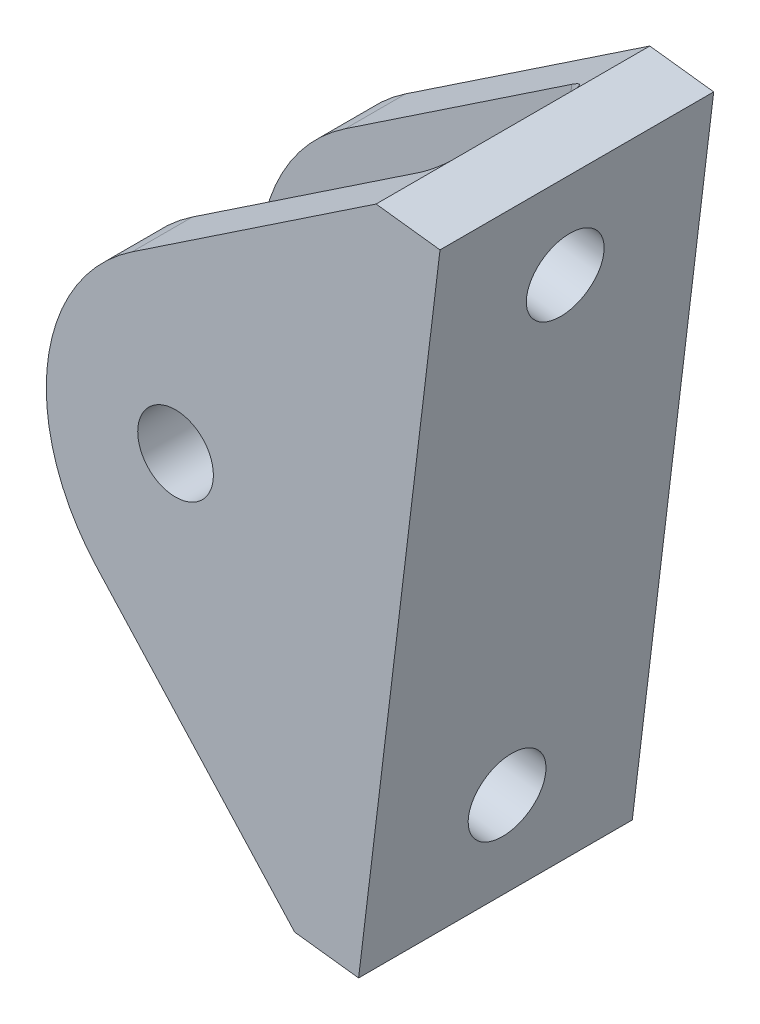
ISO-10303-21;
HEADER;
FILE_DESCRIPTION(('STEP AP214'),'2;1');
FILE_NAME('part.step','',(''),(''),'','','');
FILE_SCHEMA(('AUTOMOTIVE_DESIGN { 1 0 10303 214 1 1 1 1 }'));
ENDSEC;
DATA;
#1=APPLICATION_CONTEXT('core data for automotive mechanical design processes');
#2=APPLICATION_PROTOCOL_DEFINITION('international standard','automotive_design',2000,#1);
#3=PRODUCT_CONTEXT('',#1,'mechanical');
#4=PRODUCT('Part','Part','',(#3));
#5=PRODUCT_RELATED_PRODUCT_CATEGORY('part','',(#4));
#6=PRODUCT_DEFINITION_FORMATION('','',#4);
#7=PRODUCT_DEFINITION_CONTEXT('part definition',#1,'design');
#8=PRODUCT_DEFINITION('design','',#6,#7);
#9=PRODUCT_DEFINITION_SHAPE('','',#8);
#10=(LENGTH_UNIT() NAMED_UNIT(*) SI_UNIT(.MILLI.,.METRE.));
#11=(NAMED_UNIT(*) PLANE_ANGLE_UNIT() SI_UNIT($,.RADIAN.));
#12=(NAMED_UNIT(*) SI_UNIT($,.STERADIAN.) SOLID_ANGLE_UNIT());
#13=UNCERTAINTY_MEASURE_WITH_UNIT(LENGTH_MEASURE(1.E-05),#10,'distance_accuracy_value','');
#14=(GEOMETRIC_REPRESENTATION_CONTEXT(3) GLOBAL_UNCERTAINTY_ASSIGNED_CONTEXT((#13)) GLOBAL_UNIT_ASSIGNED_CONTEXT((#10,
#11,#12)) REPRESENTATION_CONTEXT('',''));
#15=CARTESIAN_POINT('',(0.,0.,0.));
#16=DIRECTION('',(0.,0.,1.));
#17=DIRECTION('',(1.,0.,0.));
#18=AXIS2_PLACEMENT_3D('',#15,#16,#17);
#19=CARTESIAN_POINT('',(-43.8883990487637,47.6307972317961,129.45));
#20=DIRECTION('',(0.55644779287138,-0.830882575222618,0.));
#21=DIRECTION('',(0.830882575222618,0.55644779287138,0.));
#22=AXIS2_PLACEMENT_3D('',#19,#20,#21);
#23=PLANE('',#22);
#24=DIRECTION('',(0.830882575222618,0.55644779287138,0.));
#25=VECTOR('',#24,1.);
#26=CARTESIAN_POINT('',(-43.8883990487637,47.6307972317961,125.7));
#27=LINE('',#26,#25);
#28=CARTESIAN_POINT('',(-59.0505832356892,37.4765778781606,125.7));
#29=VERTEX_POINT('',#28);
#30=CARTESIAN_POINT('',(-44.9847814916762,46.8965423458537,125.7));
#31=VERTEX_POINT('',#30);
#32=EDGE_CURVE('E142',#29,#31,#27,.T.);
#33=ORIENTED_EDGE('',*,*,#32,.F.);
#34=DIRECTION('',(0.,0.,-1.));
#35=VECTOR('',#34,1.);
#36=CARTESIAN_POINT('',(-59.0505832356892,37.4765778781606,129.45));
#37=LINE('',#36,#35);
#38=CARTESIAN_POINT('',(-59.0505832356892,37.4765778781606,129.45));
#39=VERTEX_POINT('',#38);
#40=EDGE_CURVE('E141',#39,#29,#37,.T.);
#41=ORIENTED_EDGE('',*,*,#40,.F.);
#42=DIRECTION('',(-0.830882575222618,-0.55644779287138,0.));
#43=VECTOR('',#42,1.);
#44=CARTESIAN_POINT('',(-43.8883990487637,47.6307972317961,129.45));
#45=LINE('',#44,#43);
#46=CARTESIAN_POINT('',(-43.8883990487637,47.6307972317961,129.45));
#47=VERTEX_POINT('',#46);
#48=EDGE_CURVE('E228',#47,#39,#45,.T.);
#49=ORIENTED_EDGE('',*,*,#48,.F.);
#50=DIRECTION('',(0.,0.,-1.));
#51=VECTOR('',#50,1.);
#52=CARTESIAN_POINT('',(-43.8883990487637,47.6307972317961,129.45));
#53=LINE('',#52,#51);
#54=CARTESIAN_POINT('',(-43.8883990487637,47.6307972317961,124.7));
#55=VERTEX_POINT('',#54);
#56=EDGE_CURVE('E155',#47,#55,#53,.T.);
#57=ORIENTED_EDGE('',*,*,#56,.T.);
#58=CARTESIAN_POINT('',(-44.9847814916762,46.8965423458537,124.7));
#59=DIRECTION('',(0.55644779287138,-0.830882575222618,0.));
#60=DIRECTION('',(0.830882575222618,0.55644779287138,0.));
#61=AXIS2_PLACEMENT_3D('',#58,#59,#60);
#62=ELLIPSE('',#61,1.31953957828363,1.);
#63=EDGE_CURVE('E177',#55,#31,#62,.T.);
#64=ORIENTED_EDGE('',*,*,#63,.T.);
#65=EDGE_LOOP('',(#33,#41,#49,#57,#64));
#66=FACE_BOUND('',#65,.T.);
#67=ADVANCED_FACE('F36',(#66),#23,.F.);
#68=CARTESIAN_POINT('',(-52.3732097212326,27.5059869754892,129.45));
#69=DIRECTION('',(0.,0.,-1.));
#70=DIRECTION('',(-1.,0.,0.));
#71=AXIS2_PLACEMENT_3D('',#68,#69,#70);
#72=CYLINDRICAL_SURFACE('',#71,12.);
#73=CARTESIAN_POINT('',(-52.3732097212326,27.5059869754892,125.7));
#74=DIRECTION('',(0.,0.,-1.));
#75=DIRECTION('',(-1.,0.,0.));
#76=AXIS2_PLACEMENT_3D('',#73,#74,#75);
#77=CIRCLE('',#76,12.);
#78=CARTESIAN_POINT('',(-61.2404899313599,19.4207323922936,125.7));
#79=VERTEX_POINT('',#78);
#80=EDGE_CURVE('E123',#79,#29,#77,.T.);
#81=ORIENTED_EDGE('',*,*,#80,.F.);
#82=DIRECTION('',(0.,0.,-1.));
#83=VECTOR('',#82,1.);
#84=CARTESIAN_POINT('',(-61.2404899313599,19.4207323922936,129.45));
#85=LINE('',#84,#83);
#86=CARTESIAN_POINT('',(-61.2404899313599,19.4207323922936,129.45));
#87=VERTEX_POINT('',#86);
#88=EDGE_CURVE('E138',#87,#79,#85,.T.);
#89=ORIENTED_EDGE('',*,*,#88,.F.);
#90=CARTESIAN_POINT('',(-52.3732097212326,27.5059869754892,129.45));
#91=DIRECTION('',(0.,0.,1.));
#92=DIRECTION('',(1.,0.,0.));
#93=AXIS2_PLACEMENT_3D('',#90,#91,#92);
#94=CIRCLE('',#93,12.);
#95=EDGE_CURVE('E230',#39,#87,#94,.T.);
#96=ORIENTED_EDGE('',*,*,#95,.F.);
#97=ORIENTED_EDGE('',*,*,#40,.T.);
#98=EDGE_LOOP('',(#81,#89,#96,#97));
#99=FACE_BOUND('',#98,.T.);
#100=ADVANCED_FACE('F136',(#99),#72,.T.);
#101=CARTESIAN_POINT('',(-61.2404899313599,19.4207323922936,129.45));
#102=DIRECTION('',(0.738940017510608,0.673771215266297,0.));
#103=DIRECTION('',(-0.673771215266297,0.738940017510608,0.));
#104=AXIS2_PLACEMENT_3D('',#101,#102,#103);
#105=PLANE('',#104);
#106=DIRECTION('',(-0.673771215266297,0.738940017510608,0.));
#107=VECTOR('',#106,1.);
#108=CARTESIAN_POINT('',(-61.2404899313599,19.4207323922936,125.7));
#109=LINE('',#108,#107);
#110=CARTESIAN_POINT('',(-49.8343868099661,6.91140303942213,125.7));
#111=VERTEX_POINT('',#110);
#112=EDGE_CURVE('E119',#111,#79,#109,.T.);
#113=ORIENTED_EDGE('',*,*,#112,.F.);
#114=CARTESIAN_POINT('',(-49.8343868099661,6.91140303942213,124.7));
#115=DIRECTION('',(0.738940017510608,0.673771215266297,0.));
#116=DIRECTION('',(-0.673771215266297,0.738940017510608,0.));
#117=AXIS2_PLACEMENT_3D('',#114,#115,#116);
#118=ELLIPSE('',#117,1.31953957828363,1.);
#119=CARTESIAN_POINT('',(-48.9453190247139,5.93634244033928,124.7));
#120=VERTEX_POINT('',#119);
#121=EDGE_CURVE('E179',#111,#120,#118,.T.);
#122=ORIENTED_EDGE('',*,*,#121,.T.);
#123=DIRECTION('',(0.,0.,-1.));
#124=VECTOR('',#123,1.);
#125=CARTESIAN_POINT('',(-48.9453190247139,5.93634244033928,129.45));
#126=LINE('',#125,#124);
#127=CARTESIAN_POINT('',(-48.9453190247139,5.93634244033928,129.45));
#128=VERTEX_POINT('',#127);
#129=EDGE_CURVE('E151',#128,#120,#126,.T.);
#130=ORIENTED_EDGE('',*,*,#129,.F.);
#131=DIRECTION('',(0.673771215266297,-0.738940017510608,0.));
#132=VECTOR('',#131,1.);
#133=CARTESIAN_POINT('',(-61.2404899313599,19.4207323922936,129.45));
#134=LINE('',#133,#132);
#135=EDGE_CURVE('E146',#87,#128,#134,.T.);
#136=ORIENTED_EDGE('',*,*,#135,.F.);
#137=ORIENTED_EDGE('',*,*,#88,.T.);
#138=EDGE_LOOP('',(#113,#122,#130,#136,#137));
#139=FACE_BOUND('',#138,.T.);
#140=ADVANCED_FACE('F144',(#139),#105,.F.);
#141=CARTESIAN_POINT('',(-56.3441101775619,27.9875984017701,129.45));
#142=DIRECTION('',(0.,0.,-1.));
#143=DIRECTION('',(-1.,0.,0.));
#144=AXIS2_PLACEMENT_3D('',#141,#142,#143);
#145=CYLINDRICAL_SURFACE('',#144,2.35);
#146=CARTESIAN_POINT('',(-56.3441101775619,27.9875984017701,129.45));
#147=DIRECTION('',(0.,0.,1.));
#148=DIRECTION('',(1.,0.,0.));
#149=AXIS2_PLACEMENT_3D('',#146,#147,#148);
#150=CIRCLE('',#149,2.35);
#151=CARTESIAN_POINT('',(-53.9941101775619,27.9875984017701,129.45));
#152=VERTEX_POINT('',#151);
#153=EDGE_CURVE('E216',#152,#152,#150,.T.);
#154=ORIENTED_EDGE('',*,*,#153,.T.);
#155=EDGE_LOOP('',(#154));
#156=FACE_BOUND('',#155,.T.);
#157=CARTESIAN_POINT('',(-56.3441101775619,27.9875984017701,125.7));
#158=DIRECTION('',(0.,0.,-1.));
#159=DIRECTION('',(-1.,0.,0.));
#160=AXIS2_PLACEMENT_3D('',#157,#158,#159);
#161=CIRCLE('',#160,2.35);
#162=CARTESIAN_POINT('',(-58.6941101775619,27.9875984017701,125.7));
#163=VERTEX_POINT('',#162);
#164=EDGE_CURVE('E131',#163,#163,#161,.T.);
#165=ORIENTED_EDGE('',*,*,#164,.T.);
#166=EDGE_LOOP('',(#165));
#167=FACE_BOUND('',#166,.T.);
#168=ADVANCED_FACE('F314',(#156,#167),#145,.F.);
#169=CARTESIAN_POINT('',(-52.3732097212326,27.5059869754892,129.45));
#170=DIRECTION('',(0.,0.,1.));
#171=DIRECTION('',(1.,0.,0.));
#172=AXIS2_PLACEMENT_3D('',#169,#170,#171);
#173=PLANE('',#172);
#174=DIRECTION('',(0.120402856570244,0.992725114082305,0.));
#175=VECTOR('',#174,1.);
#176=CARTESIAN_POINT('',(-39.9174985924345,47.1491858055151,129.45));
#177=LINE('',#176,#175);
#178=CARTESIAN_POINT('',(-44.9744185683847,5.45473101405832,129.45));
#179=VERTEX_POINT('',#178);
#180=CARTESIAN_POINT('',(-39.9174985924345,47.1491858055151,129.45));
#181=VERTEX_POINT('',#180);
#182=EDGE_CURVE('E222',#179,#181,#177,.T.);
#183=ORIENTED_EDGE('',*,*,#182,.T.);
#184=DIRECTION('',(-0.992725114082305,0.120402856570242,0.));
#185=VECTOR('',#184,1.);
#186=CARTESIAN_POINT('',(-43.8883990487637,47.6307972317961,129.45));
#187=LINE('',#186,#185);
#188=EDGE_CURVE('E225',#181,#47,#187,.T.);
#189=ORIENTED_EDGE('',*,*,#188,.T.);
#190=ORIENTED_EDGE('',*,*,#48,.T.);
#191=ORIENTED_EDGE('',*,*,#95,.T.);
#192=ORIENTED_EDGE('',*,*,#135,.T.);
#193=DIRECTION('',(0.992725114082305,-0.120402856570242,0.));
#194=VECTOR('',#193,1.);
#195=CARTESIAN_POINT('',(-44.9744185683847,5.45473101405832,129.45));
#196=LINE('',#195,#194);
#197=EDGE_CURVE('E233',#128,#179,#196,.T.);
#198=ORIENTED_EDGE('',*,*,#197,.T.);
#199=EDGE_LOOP('',(#183,#189,#190,#191,#192,#198));
#200=FACE_BOUND('',#199,.T.);
#201=ORIENTED_EDGE('',*,*,#153,.F.);
#202=EDGE_LOOP('',(#201));
#203=FACE_BOUND('',#202,.T.);
#204=ADVANCED_FACE('F265',(#200,#203),#173,.T.);
#205=CARTESIAN_POINT('',(-52.3732097212326,27.5059869754892,112.45));
#206=DIRECTION('',(0.,0.,1.));
#207=DIRECTION('',(1.,0.,0.));
#208=AXIS2_PLACEMENT_3D('',#205,#206,#207);
#209=PLANE('',#208);
#210=DIRECTION('',(0.120402856570244,0.992725114082305,0.));
#211=VECTOR('',#210,1.);
#212=CARTESIAN_POINT('',(-39.9174985924345,47.1491858055151,112.45));
#213=LINE('',#212,#211);
#214=CARTESIAN_POINT('',(-44.9744185683847,5.45473101405832,112.45));
#215=VERTEX_POINT('',#214);
#216=CARTESIAN_POINT('',(-39.9174985924345,47.1491858055151,112.45));
#217=VERTEX_POINT('',#216);
#218=EDGE_CURVE('E219',#215,#217,#213,.T.);
#219=ORIENTED_EDGE('',*,*,#218,.F.);
#220=DIRECTION('',(0.992725114082305,-0.120402856570242,0.));
#221=VECTOR('',#220,1.);
#222=CARTESIAN_POINT('',(-44.9744185683847,5.45473101405832,112.45));
#223=LINE('',#222,#221);
#224=CARTESIAN_POINT('',(-48.9453190247139,5.93634244033928,112.45));
#225=VERTEX_POINT('',#224);
#226=EDGE_CURVE('E226',#225,#215,#223,.T.);
#227=ORIENTED_EDGE('',*,*,#226,.F.);
#228=DIRECTION('',(0.673771215266297,-0.738940017510608,0.));
#229=VECTOR('',#228,1.);
#230=CARTESIAN_POINT('',(-61.2404899313599,19.4207323922936,112.45));
#231=LINE('',#230,#229);
#232=CARTESIAN_POINT('',(-61.2404899313599,19.4207323922936,112.45));
#233=VERTEX_POINT('',#232);
#234=EDGE_CURVE('E245',#233,#225,#231,.T.);
#235=ORIENTED_EDGE('',*,*,#234,.F.);
#236=CARTESIAN_POINT('',(-52.3732097212326,27.5059869754892,112.45));
#237=DIRECTION('',(0.,0.,1.));
#238=DIRECTION('',(1.,0.,0.));
#239=AXIS2_PLACEMENT_3D('',#236,#237,#238);
#240=CIRCLE('',#239,12.);
#241=CARTESIAN_POINT('',(-59.0505832356892,37.4765778781606,112.45));
#242=VERTEX_POINT('',#241);
#243=EDGE_CURVE('E242',#242,#233,#240,.T.);
#244=ORIENTED_EDGE('',*,*,#243,.F.);
#245=DIRECTION('',(-0.830882575222618,-0.55644779287138,0.));
#246=VECTOR('',#245,1.);
#247=CARTESIAN_POINT('',(-43.8883990487637,47.6307972317961,112.45));
#248=LINE('',#247,#246);
#249=CARTESIAN_POINT('',(-43.8883990487637,47.6307972317961,112.45));
#250=VERTEX_POINT('',#249);
#251=EDGE_CURVE('E240',#250,#242,#248,.T.);
#252=ORIENTED_EDGE('',*,*,#251,.F.);
#253=DIRECTION('',(-0.992725114082305,0.120402856570242,0.));
#254=VECTOR('',#253,1.);
#255=CARTESIAN_POINT('',(-43.8883990487637,47.6307972317961,112.45));
#256=LINE('',#255,#254);
#257=EDGE_CURVE('E238',#217,#250,#256,.T.);
#258=ORIENTED_EDGE('',*,*,#257,.F.);
#259=EDGE_LOOP('',(#219,#227,#235,#244,#252,#258));
#260=FACE_BOUND('',#259,.T.);
#261=CARTESIAN_POINT('',(-56.3441101775619,27.9875984017701,112.45));
#262=DIRECTION('',(0.,0.,1.));
#263=DIRECTION('',(1.,0.,0.));
#264=AXIS2_PLACEMENT_3D('',#261,#262,#263);
#265=CIRCLE('',#264,2.35);
#266=CARTESIAN_POINT('',(-53.9941101775619,27.9875984017701,112.45));
#267=VERTEX_POINT('',#266);
#268=EDGE_CURVE('E215',#267,#267,#265,.T.);
#269=ORIENTED_EDGE('',*,*,#268,.T.);
#270=EDGE_LOOP('',(#269));
#271=FACE_BOUND('',#270,.T.);
#272=ADVANCED_FACE('F256',(#260,#271),#209,.F.);
#273=CARTESIAN_POINT('',(-39.9174985924345,47.1491858055151,129.45));
#274=DIRECTION('',(-0.992725114082305,0.120402856570244,0.));
#275=DIRECTION('',(-0.120402856570244,-0.992725114082305,0.));
#276=AXIS2_PLACEMENT_3D('',#273,#274,#275);
#277=PLANE('',#276);
#278=CARTESIAN_POINT('',(-44.2520014289633,11.4110816985521,120.95));
#279=DIRECTION('',(-0.992725114082305,0.120402856570244,0.));
#280=DIRECTION('',(-0.120402856570244,-0.992725114082305,0.));
#281=AXIS2_PLACEMENT_3D('',#278,#279,#280);
#282=CIRCLE('',#281,2.4);
#283=CARTESIAN_POINT('',(-44.5409682847318,9.02854142475462,120.95));
#284=VERTEX_POINT('',#283);
#285=EDGE_CURVE('E440',#284,#284,#282,.T.);
#286=ORIENTED_EDGE('',*,*,#285,.T.);
#287=EDGE_LOOP('',(#286));
#288=FACE_BOUND('',#287,.T.);
#289=CARTESIAN_POINT('',(-40.639915731856,41.1928351210213,120.95));
#290=DIRECTION('',(-0.992725114082305,0.120402856570244,0.));
#291=DIRECTION('',(-0.120402856570244,-0.992725114082305,0.));
#292=AXIS2_PLACEMENT_3D('',#289,#290,#291);
#293=CIRCLE('',#292,2.4);
#294=CARTESIAN_POINT('',(-40.9288825876245,38.8102948472238,120.95));
#295=VERTEX_POINT('',#294);
#296=EDGE_CURVE('E202',#295,#295,#293,.T.);
#297=ORIENTED_EDGE('',*,*,#296,.T.);
#298=EDGE_LOOP('',(#297));
#299=FACE_BOUND('',#298,.T.);
#300=ORIENTED_EDGE('',*,*,#218,.T.);
#301=DIRECTION('',(0.,0.,-1.));
#302=VECTOR('',#301,1.);
#303=CARTESIAN_POINT('',(-39.9174985924345,47.1491858055151,129.45));
#304=LINE('',#303,#302);
#305=EDGE_CURVE('E157',#181,#217,#304,.T.);
#306=ORIENTED_EDGE('',*,*,#305,.F.);
#307=ORIENTED_EDGE('',*,*,#182,.F.);
#308=DIRECTION('',(0.,0.,-1.));
#309=VECTOR('',#308,1.);
#310=CARTESIAN_POINT('',(-44.9744185683847,5.45473101405832,129.45));
#311=LINE('',#310,#309);
#312=EDGE_CURVE('E235',#179,#215,#311,.T.);
#313=ORIENTED_EDGE('',*,*,#312,.T.);
#314=EDGE_LOOP('',(#300,#306,#307,#313));
#315=FACE_BOUND('',#314,.T.);
#316=ADVANCED_FACE('F252',(#288,#299,#315),#277,.F.);
#317=CARTESIAN_POINT('',(-43.8883990487637,47.6307972317961,129.45));
#318=DIRECTION('',(-0.120402856570242,-0.992725114082305,0.));
#319=DIRECTION('',(0.992725114082305,-0.120402856570242,0.));
#320=AXIS2_PLACEMENT_3D('',#317,#318,#319);
#321=PLANE('',#320);
#322=ORIENTED_EDGE('',*,*,#257,.T.);
#323=CARTESIAN_POINT('',(-43.8883990487637,47.6307972317961,117.2));
#324=VERTEX_POINT('',#323);
#325=EDGE_CURVE('E52',#324,#250,#53,.T.);
#326=ORIENTED_EDGE('',*,*,#325,.F.);
#327=DIRECTION('',(0.,0.,1.));
#328=VECTOR('',#327,1.);
#329=CARTESIAN_POINT('',(-43.8883990487637,47.6307972317961,116.2));
#330=LINE('',#329,#328);
#331=EDGE_CURVE('E163',#324,#55,#330,.T.);
#332=ORIENTED_EDGE('',*,*,#331,.T.);
#333=ORIENTED_EDGE('',*,*,#56,.F.);
#334=ORIENTED_EDGE('',*,*,#188,.F.);
#335=ORIENTED_EDGE('',*,*,#305,.T.);
#336=EDGE_LOOP('',(#322,#326,#332,#333,#334,#335));
#337=FACE_BOUND('',#336,.T.);
#338=ADVANCED_FACE('F261',(#337),#321,.F.);
#339=CARTESIAN_POINT('',(-59.0505832356892,37.4765778781606,116.2));
#340=VERTEX_POINT('',#339);
#341=EDGE_CURVE('E147',#340,#242,#37,.T.);
#342=ORIENTED_EDGE('',*,*,#341,.F.);
#343=DIRECTION('',(0.830882575222618,0.55644779287138,0.));
#344=VECTOR('',#343,1.);
#345=CARTESIAN_POINT('',(-43.8883990487637,47.6307972317961,116.2));
#346=LINE('',#345,#344);
#347=CARTESIAN_POINT('',(-44.9847814916762,46.8965423458537,116.2));
#348=VERTEX_POINT('',#347);
#349=EDGE_CURVE('E187',#340,#348,#346,.T.);
#350=ORIENTED_EDGE('',*,*,#349,.T.);
#351=CARTESIAN_POINT('',(-44.9847814916762,46.8965423458537,117.2));
#352=DIRECTION('',(0.55644779287138,-0.830882575222618,0.));
#353=DIRECTION('',(-0.830882575222618,-0.55644779287138,0.));
#354=AXIS2_PLACEMENT_3D('',#351,#352,#353);
#355=ELLIPSE('',#354,1.31953957828363,1.);
#356=EDGE_CURVE('E45',#348,#324,#355,.T.);
#357=ORIENTED_EDGE('',*,*,#356,.T.);
#358=ORIENTED_EDGE('',*,*,#325,.T.);
#359=ORIENTED_EDGE('',*,*,#251,.T.);
#360=EDGE_LOOP('',(#342,#350,#357,#358,#359));
#361=FACE_BOUND('',#360,.T.);
#362=ADVANCED_FACE('F185',(#361),#23,.F.);
#363=CARTESIAN_POINT('',(-61.2404899313599,19.4207323922936,116.2));
#364=VERTEX_POINT('',#363);
#365=EDGE_CURVE('E148',#364,#233,#85,.T.);
#366=ORIENTED_EDGE('',*,*,#365,.F.);
#367=CARTESIAN_POINT('',(-52.3732097212326,27.5059869754892,116.2));
#368=DIRECTION('',(0.,0.,-1.));
#369=DIRECTION('',(-1.,0.,0.));
#370=AXIS2_PLACEMENT_3D('',#367,#368,#369);
#371=CIRCLE('',#370,12.);
#372=EDGE_CURVE('E211',#364,#340,#371,.T.);
#373=ORIENTED_EDGE('',*,*,#372,.T.);
#374=ORIENTED_EDGE('',*,*,#341,.T.);
#375=ORIENTED_EDGE('',*,*,#243,.T.);
#376=EDGE_LOOP('',(#366,#373,#374,#375));
#377=FACE_BOUND('',#376,.T.);
#378=ADVANCED_FACE('F278',(#377),#72,.T.);
#379=CARTESIAN_POINT('',(-48.9453190247139,5.93634244033928,117.2));
#380=VERTEX_POINT('',#379);
#381=EDGE_CURVE('E199',#380,#225,#126,.T.);
#382=ORIENTED_EDGE('',*,*,#381,.F.);
#383=CARTESIAN_POINT('',(-49.8343868099661,6.91140303942213,117.2));
#384=DIRECTION('',(0.738940017510608,0.673771215266297,0.));
#385=DIRECTION('',(0.673771215266297,-0.738940017510608,0.));
#386=AXIS2_PLACEMENT_3D('',#383,#384,#385);
#387=ELLIPSE('',#386,1.31953957828363,1.);
#388=CARTESIAN_POINT('',(-49.8343868099661,6.91140303942213,116.2));
#389=VERTEX_POINT('',#388);
#390=EDGE_CURVE('E11',#380,#389,#387,.T.);
#391=ORIENTED_EDGE('',*,*,#390,.T.);
#392=DIRECTION('',(-0.673771215266297,0.738940017510608,0.));
#393=VECTOR('',#392,1.);
#394=CARTESIAN_POINT('',(-61.2404899313599,19.4207323922936,116.2));
#395=LINE('',#394,#393);
#396=EDGE_CURVE('E167',#389,#364,#395,.T.);
#397=ORIENTED_EDGE('',*,*,#396,.T.);
#398=ORIENTED_EDGE('',*,*,#365,.T.);
#399=ORIENTED_EDGE('',*,*,#234,.T.);
#400=EDGE_LOOP('',(#382,#391,#397,#398,#399));
#401=FACE_BOUND('',#400,.T.);
#402=ADVANCED_FACE('F285',(#401),#105,.F.);
#403=CARTESIAN_POINT('',(-44.9744185683847,5.45473101405832,129.45));
#404=DIRECTION('',(0.120402856570242,0.992725114082305,0.));
#405=DIRECTION('',(-0.992725114082305,0.120402856570242,0.));
#406=AXIS2_PLACEMENT_3D('',#403,#404,#405);
#407=PLANE('',#406);
#408=ORIENTED_EDGE('',*,*,#226,.T.);
#409=ORIENTED_EDGE('',*,*,#312,.F.);
#410=ORIENTED_EDGE('',*,*,#197,.F.);
#411=ORIENTED_EDGE('',*,*,#129,.T.);
#412=DIRECTION('',(0.,0.,1.));
#413=VECTOR('',#412,1.);
#414=CARTESIAN_POINT('',(-48.9453190247139,5.93634244033928,116.2));
#415=LINE('',#414,#413);
#416=EDGE_CURVE('E195',#380,#120,#415,.T.);
#417=ORIENTED_EDGE('',*,*,#416,.F.);
#418=ORIENTED_EDGE('',*,*,#381,.T.);
#419=EDGE_LOOP('',(#408,#409,#410,#411,#417,#418));
#420=FACE_BOUND('',#419,.T.);
#421=ADVANCED_FACE('F198',(#420),#407,.F.);
#422=CARTESIAN_POINT('',(-56.3441101775619,27.9875984017701,116.2));
#423=DIRECTION('',(0.,0.,-1.));
#424=DIRECTION('',(-1.,0.,0.));
#425=AXIS2_PLACEMENT_3D('',#422,#423,#424);
#426=CIRCLE('',#425,2.35);
#427=CARTESIAN_POINT('',(-58.6941101775619,27.9875984017701,116.2));
#428=VERTEX_POINT('',#427);
#429=EDGE_CURVE('E164',#428,#428,#426,.T.);
#430=ORIENTED_EDGE('',*,*,#429,.F.);
#431=EDGE_LOOP('',(#430));
#432=FACE_BOUND('',#431,.T.);
#433=ORIENTED_EDGE('',*,*,#268,.F.);
#434=EDGE_LOOP('',(#433));
#435=FACE_BOUND('',#434,.T.);
#436=ADVANCED_FACE('F310',(#432,#435),#145,.F.);
#437=CARTESIAN_POINT('',(0.,0.,116.2));
#438=DIRECTION('',(0.,0.,-1.));
#439=DIRECTION('',(-1.,0.,0.));
#440=AXIS2_PLACEMENT_3D('',#437,#438,#439);
#441=PLANE('',#440);
#442=ORIENTED_EDGE('',*,*,#429,.T.);
#443=EDGE_LOOP('',(#442));
#444=FACE_BOUND('',#443,.T.);
#445=ORIENTED_EDGE('',*,*,#396,.F.);
#446=DIRECTION('',(0.120402856570244,0.992725114082305,0.));
#447=VECTOR('',#446,1.);
#448=CARTESIAN_POINT('',(-44.881124162846,47.7512000883663,116.2));
#449=LINE('',#448,#447);
#450=EDGE_CURVE('E174',#389,#348,#449,.T.);
#451=ORIENTED_EDGE('',*,*,#450,.T.);
#452=ORIENTED_EDGE('',*,*,#349,.F.);
#453=ORIENTED_EDGE('',*,*,#372,.F.);
#454=EDGE_LOOP('',(#445,#451,#452,#453));
#455=FACE_BOUND('',#454,.T.);
#456=ADVANCED_FACE('F303',(#444,#455),#441,.F.);
#457=CARTESIAN_POINT('',(0.,0.,125.7));
#458=DIRECTION('',(0.,0.,-1.));
#459=DIRECTION('',(-1.,0.,0.));
#460=AXIS2_PLACEMENT_3D('',#457,#458,#459);
#461=PLANE('',#460);
#462=ORIENTED_EDGE('',*,*,#164,.F.);
#463=EDGE_LOOP('',(#462));
#464=FACE_BOUND('',#463,.T.);
#465=ORIENTED_EDGE('',*,*,#32,.T.);
#466=DIRECTION('',(0.120402856570244,0.992725114082305,0.));
#467=VECTOR('',#466,1.);
#468=CARTESIAN_POINT('',(-49.9380441387962,6.05674529690954,125.7));
#469=LINE('',#468,#467);
#470=EDGE_CURVE('E126',#31,#111,#469,.F.);
#471=ORIENTED_EDGE('',*,*,#470,.T.);
#472=ORIENTED_EDGE('',*,*,#112,.T.);
#473=ORIENTED_EDGE('',*,*,#80,.T.);
#474=EDGE_LOOP('',(#465,#471,#472,#473));
#475=FACE_BOUND('',#474,.T.);
#476=ADVANCED_FACE('F122',(#464,#475),#461,.T.);
#477=CARTESIAN_POINT('',(-48.9453190247139,5.93634244033928,116.2));
#478=DIRECTION('',(0.992725114082305,-0.120402856570244,0.));
#479=DIRECTION('',(0.120402856570244,0.992725114082305,0.));
#480=AXIS2_PLACEMENT_3D('',#477,#478,#479);
#481=PLANE('',#480);
#482=CARTESIAN_POINT('',(-48.2229018852925,11.8926931248331,120.95));
#483=DIRECTION('',(-0.992725114082305,0.120402856570244,0.));
#484=DIRECTION('',(-0.120402856570244,-0.992725114082305,0.));
#485=AXIS2_PLACEMENT_3D('',#482,#483,#484);
#486=CIRCLE('',#485,2.4);
#487=CARTESIAN_POINT('',(-48.5118687410611,9.51015285103559,120.95));
#488=VERTEX_POINT('',#487);
#489=EDGE_CURVE('E442',#488,#488,#486,.T.);
#490=ORIENTED_EDGE('',*,*,#489,.F.);
#491=EDGE_LOOP('',(#490));
#492=FACE_BOUND('',#491,.T.);
#493=CARTESIAN_POINT('',(-44.6108161881852,41.6744465473023,120.95));
#494=DIRECTION('',(-0.992725114082305,0.120402856570244,0.));
#495=DIRECTION('',(-0.120402856570244,-0.992725114082305,0.));
#496=AXIS2_PLACEMENT_3D('',#493,#494,#495);
#497=CIRCLE('',#496,2.4);
#498=CARTESIAN_POINT('',(-44.8997830439537,39.2919062735047,120.95));
#499=VERTEX_POINT('',#498);
#500=EDGE_CURVE('E206',#499,#499,#497,.T.);
#501=ORIENTED_EDGE('',*,*,#500,.F.);
#502=EDGE_LOOP('',(#501));
#503=FACE_BOUND('',#502,.T.);
#504=ORIENTED_EDGE('',*,*,#416,.T.);
#505=DIRECTION('',(0.120402856570244,0.992725114082305,0.));
#506=VECTOR('',#505,1.);
#507=CARTESIAN_POINT('',(-48.9453190247139,5.93634244033928,124.7));
#508=LINE('',#507,#506);
#509=EDGE_CURVE('E170',#120,#55,#508,.T.);
#510=ORIENTED_EDGE('',*,*,#509,.T.);
#511=ORIENTED_EDGE('',*,*,#331,.F.);
#512=DIRECTION('',(0.120402856570244,0.992725114082305,0.));
#513=VECTOR('',#512,1.);
#514=CARTESIAN_POINT('',(-48.9453190247139,5.93634244033928,117.2));
#515=LINE('',#514,#513);
#516=EDGE_CURVE('E160',#324,#380,#515,.F.);
#517=ORIENTED_EDGE('',*,*,#516,.T.);
#518=EDGE_LOOP('',(#504,#510,#511,#517));
#519=FACE_BOUND('',#518,.T.);
#520=ADVANCED_FACE('F194',(#492,#503,#519),#481,.F.);
#521=CARTESIAN_POINT('',(-49.9380441387962,6.05674529690953,124.7));
#522=DIRECTION('',(0.120402856570244,0.992725114082305,0.));
#523=DIRECTION('',(-0.992725114082305,0.120402856570244,0.));
#524=AXIS2_PLACEMENT_3D('',#521,#522,#523);
#525=CYLINDRICAL_SURFACE('',#524,1.);
#526=ORIENTED_EDGE('',*,*,#121,.F.);
#527=ORIENTED_EDGE('',*,*,#470,.F.);
#528=ORIENTED_EDGE('',*,*,#63,.F.);
#529=ORIENTED_EDGE('',*,*,#509,.F.);
#530=EDGE_LOOP('',(#526,#527,#528,#529));
#531=FACE_BOUND('',#530,.T.);
#532=ADVANCED_FACE('F270',(#531),#525,.F.);
#533=CARTESIAN_POINT('',(-49.9380441387962,6.05674529690954,117.2));
#534=DIRECTION('',(-0.120402856570244,-0.992725114082305,0.));
#535=DIRECTION('',(0.992725114082305,-0.120402856570244,0.));
#536=AXIS2_PLACEMENT_3D('',#533,#534,#535);
#537=CYLINDRICAL_SURFACE('',#536,1.);
#538=ORIENTED_EDGE('',*,*,#390,.F.);
#539=ORIENTED_EDGE('',*,*,#516,.F.);
#540=ORIENTED_EDGE('',*,*,#356,.F.);
#541=ORIENTED_EDGE('',*,*,#450,.F.);
#542=EDGE_LOOP('',(#538,#539,#540,#541));
#543=FACE_BOUND('',#542,.T.);
#544=ADVANCED_FACE('F38',(#543),#537,.F.);
#545=CARTESIAN_POINT('',(-44.6108161881852,41.6744465473023,120.95));
#546=DIRECTION('',(-0.992725114082305,0.120402856570244,0.));
#547=DIRECTION('',(-0.120402856570244,-0.992725114082305,0.));
#548=AXIS2_PLACEMENT_3D('',#545,#546,#547);
#549=CYLINDRICAL_SURFACE('',#548,2.4);
#550=ORIENTED_EDGE('',*,*,#296,.F.);
#551=EDGE_LOOP('',(#550));
#552=FACE_BOUND('',#551,.T.);
#553=ORIENTED_EDGE('',*,*,#500,.T.);
#554=EDGE_LOOP('',(#553));
#555=FACE_BOUND('',#554,.T.);
#556=ADVANCED_FACE('F297',(#552,#555),#549,.F.);
#557=CARTESIAN_POINT('',(-48.2229018852925,11.8926931248331,120.95));
#558=DIRECTION('',(-0.992725114082305,0.120402856570244,0.));
#559=DIRECTION('',(-0.120402856570244,-0.992725114082305,0.));
#560=AXIS2_PLACEMENT_3D('',#557,#558,#559);
#561=CYLINDRICAL_SURFACE('',#560,2.4);
#562=ORIENTED_EDGE('',*,*,#285,.F.);
#563=EDGE_LOOP('',(#562));
#564=FACE_BOUND('',#563,.T.);
#565=ORIENTED_EDGE('',*,*,#489,.T.);
#566=EDGE_LOOP('',(#565));
#567=FACE_BOUND('',#566,.T.);
#568=ADVANCED_FACE('F421',(#564,#567),#561,.F.);
#569=CLOSED_SHELL('',(#67,#100,#140,#168,#204,#272,#316,#338,#362,#378,#402,#421,#436,#456,#476,
#520,#532,#544,#556,#568));
#570=MANIFOLD_SOLID_BREP('B2',#569);
#571=ADVANCED_BREP_SHAPE_REPRESENTATION('',(#18,#570),#14);
#572=SHAPE_DEFINITION_REPRESENTATION(#9,#571);
ENDSEC;
END-ISO-10303-21;
